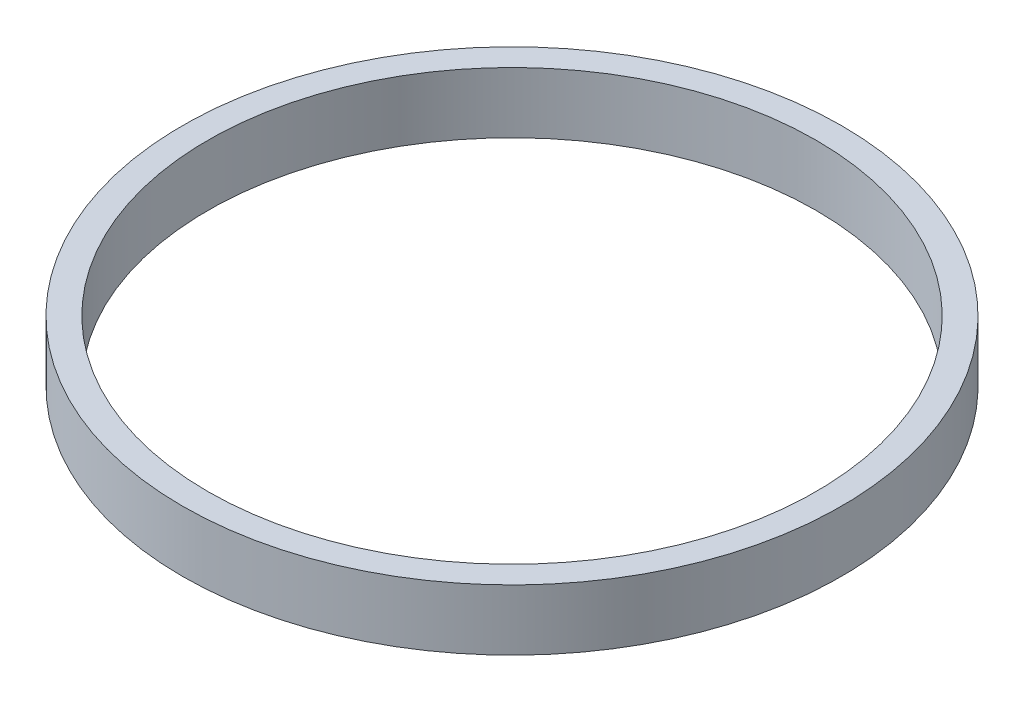
ISO-10303-21;
HEADER;
FILE_DESCRIPTION(('STEP AP214'),'2;1');
FILE_NAME('part.step','',(''),(''),'','','');
FILE_SCHEMA(('AUTOMOTIVE_DESIGN { 1 0 10303 214 1 1 1 1 }'));
ENDSEC;
DATA;
#1=APPLICATION_CONTEXT('core data for automotive mechanical design processes');
#2=APPLICATION_PROTOCOL_DEFINITION('international standard','automotive_design',2000,#1);
#3=PRODUCT_CONTEXT('',#1,'mechanical');
#4=PRODUCT('Part','Part','',(#3));
#5=PRODUCT_RELATED_PRODUCT_CATEGORY('part','',(#4));
#6=PRODUCT_DEFINITION_FORMATION('','',#4);
#7=PRODUCT_DEFINITION_CONTEXT('part definition',#1,'design');
#8=PRODUCT_DEFINITION('design','',#6,#7);
#9=PRODUCT_DEFINITION_SHAPE('','',#8);
#10=(LENGTH_UNIT() NAMED_UNIT(*) SI_UNIT(.MILLI.,.METRE.));
#11=(NAMED_UNIT(*) PLANE_ANGLE_UNIT() SI_UNIT($,.RADIAN.));
#12=(NAMED_UNIT(*) SI_UNIT($,.STERADIAN.) SOLID_ANGLE_UNIT());
#13=UNCERTAINTY_MEASURE_WITH_UNIT(LENGTH_MEASURE(1.E-05),#10,'distance_accuracy_value','');
#14=(GEOMETRIC_REPRESENTATION_CONTEXT(3) GLOBAL_UNCERTAINTY_ASSIGNED_CONTEXT((#13)) GLOBAL_UNIT_ASSIGNED_CONTEXT((#10,
#11,#12)) REPRESENTATION_CONTEXT('',''));
#15=CARTESIAN_POINT('',(0.,0.,0.));
#16=DIRECTION('',(0.,0.,1.));
#17=DIRECTION('',(1.,0.,0.));
#18=AXIS2_PLACEMENT_3D('',#15,#16,#17);
#19=CARTESIAN_POINT('',(0.,6.,0.));
#20=DIRECTION('',(0.,1.,0.));
#21=DIRECTION('',(0.,0.,1.));
#22=AXIS2_PLACEMENT_3D('',#19,#20,#21);
#23=PLANE('',#22);
#24=CARTESIAN_POINT('',(0.,6.,0.));
#25=DIRECTION('',(0.,1.,0.));
#26=DIRECTION('',(0.,0.,1.));
#27=AXIS2_PLACEMENT_3D('',#24,#25,#26);
#28=CIRCLE('',#27,32.5);
#29=CARTESIAN_POINT('',(0.,6.,32.5));
#30=VERTEX_POINT('',#29);
#31=EDGE_CURVE('E10',#30,#30,#28,.T.);
#32=ORIENTED_EDGE('',*,*,#31,.T.);
#33=EDGE_LOOP('',(#32));
#34=FACE_BOUND('',#33,.T.);
#35=CARTESIAN_POINT('',(0.,6.,0.));
#36=DIRECTION('',(0.,1.,0.));
#37=DIRECTION('',(0.,0.,1.));
#38=AXIS2_PLACEMENT_3D('',#35,#36,#37);
#39=CIRCLE('',#38,30.);
#40=CARTESIAN_POINT('',(0.,6.,30.));
#41=VERTEX_POINT('',#40);
#42=EDGE_CURVE('E42',#41,#41,#39,.T.);
#43=ORIENTED_EDGE('',*,*,#42,.F.);
#44=EDGE_LOOP('',(#43));
#45=FACE_BOUND('',#44,.T.);
#46=ADVANCED_FACE('F31',(#34,#45),#23,.T.);
#47=CARTESIAN_POINT('',(0.,0.,0.));
#48=DIRECTION('',(0.,1.,0.));
#49=DIRECTION('',(0.,0.,1.));
#50=AXIS2_PLACEMENT_3D('',#47,#48,#49);
#51=PLANE('',#50);
#52=CARTESIAN_POINT('',(0.,0.,0.));
#53=DIRECTION('',(0.,1.,0.));
#54=DIRECTION('',(0.,0.,1.));
#55=AXIS2_PLACEMENT_3D('',#52,#53,#54);
#56=CIRCLE('',#55,32.5);
#57=CARTESIAN_POINT('',(0.,0.,32.5));
#58=VERTEX_POINT('',#57);
#59=EDGE_CURVE('E35',#58,#58,#56,.T.);
#60=ORIENTED_EDGE('',*,*,#59,.F.);
#61=EDGE_LOOP('',(#60));
#62=FACE_BOUND('',#61,.T.);
#63=CARTESIAN_POINT('',(0.,0.,0.));
#64=DIRECTION('',(0.,1.,0.));
#65=DIRECTION('',(0.,0.,1.));
#66=AXIS2_PLACEMENT_3D('',#63,#64,#65);
#67=CIRCLE('',#66,30.);
#68=CARTESIAN_POINT('',(0.,0.,30.));
#69=VERTEX_POINT('',#68);
#70=EDGE_CURVE('E44',#69,#69,#67,.T.);
#71=ORIENTED_EDGE('',*,*,#70,.T.);
#72=EDGE_LOOP('',(#71));
#73=FACE_BOUND('',#72,.T.);
#74=ADVANCED_FACE('F54',(#62,#73),#51,.F.);
#75=CARTESIAN_POINT('',(0.,6.,0.));
#76=DIRECTION('',(0.,-1.,0.));
#77=DIRECTION('',(0.,0.,-1.));
#78=AXIS2_PLACEMENT_3D('',#75,#76,#77);
#79=CYLINDRICAL_SURFACE('',#78,32.5);
#80=ORIENTED_EDGE('',*,*,#31,.F.);
#81=EDGE_LOOP('',(#80));
#82=FACE_BOUND('',#81,.T.);
#83=ORIENTED_EDGE('',*,*,#59,.T.);
#84=EDGE_LOOP('',(#83));
#85=FACE_BOUND('',#84,.T.);
#86=ADVANCED_FACE('F33',(#82,#85),#79,.T.);
#87=CARTESIAN_POINT('',(0.,6.,0.));
#88=DIRECTION('',(0.,-1.,0.));
#89=DIRECTION('',(0.,0.,-1.));
#90=AXIS2_PLACEMENT_3D('',#87,#88,#89);
#91=CYLINDRICAL_SURFACE('',#90,30.);
#92=ORIENTED_EDGE('',*,*,#42,.T.);
#93=EDGE_LOOP('',(#92));
#94=FACE_BOUND('',#93,.T.);
#95=ORIENTED_EDGE('',*,*,#70,.F.);
#96=EDGE_LOOP('',(#95));
#97=FACE_BOUND('',#96,.T.);
#98=ADVANCED_FACE('F50',(#94,#97),#91,.F.);
#99=CLOSED_SHELL('',(#46,#74,#86,#98));
#100=MANIFOLD_SOLID_BREP('B2',#99);
#101=ADVANCED_BREP_SHAPE_REPRESENTATION('',(#18,#100),#14);
#102=SHAPE_DEFINITION_REPRESENTATION(#9,#101);
ENDSEC;
END-ISO-10303-21;
